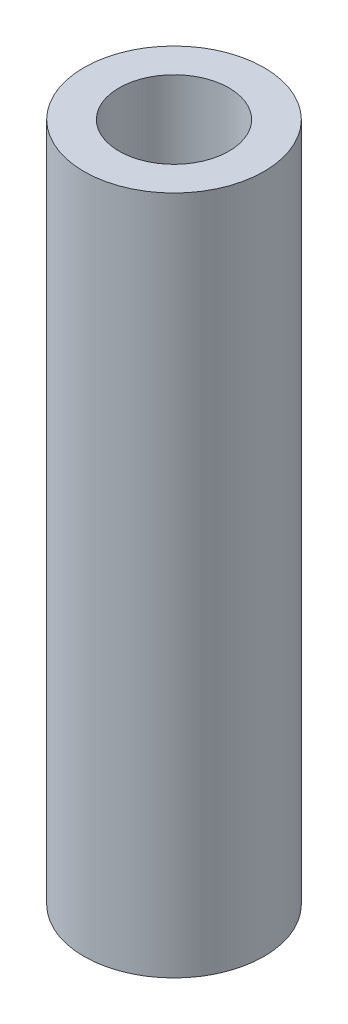
ISO-10303-21;
HEADER;
FILE_DESCRIPTION(('STEP AP214'),'2;1');
FILE_NAME('part.step','',(''),(''),'','','');
FILE_SCHEMA(('AUTOMOTIVE_DESIGN { 1 0 10303 214 1 1 1 1 }'));
ENDSEC;
DATA;
#1=APPLICATION_CONTEXT('core data for automotive mechanical design processes');
#2=APPLICATION_PROTOCOL_DEFINITION('international standard','automotive_design',2000,#1);
#3=PRODUCT_CONTEXT('',#1,'mechanical');
#4=PRODUCT('Part','Part','',(#3));
#5=PRODUCT_RELATED_PRODUCT_CATEGORY('part','',(#4));
#6=PRODUCT_DEFINITION_FORMATION('','',#4);
#7=PRODUCT_DEFINITION_CONTEXT('part definition',#1,'design');
#8=PRODUCT_DEFINITION('design','',#6,#7);
#9=PRODUCT_DEFINITION_SHAPE('','',#8);
#10=(LENGTH_UNIT() NAMED_UNIT(*) SI_UNIT(.MILLI.,.METRE.));
#11=(NAMED_UNIT(*) PLANE_ANGLE_UNIT() SI_UNIT($,.RADIAN.));
#12=(NAMED_UNIT(*) SI_UNIT($,.STERADIAN.) SOLID_ANGLE_UNIT());
#13=UNCERTAINTY_MEASURE_WITH_UNIT(LENGTH_MEASURE(1.E-05),#10,'distance_accuracy_value','');
#14=(GEOMETRIC_REPRESENTATION_CONTEXT(3) GLOBAL_UNCERTAINTY_ASSIGNED_CONTEXT((#13)) GLOBAL_UNIT_ASSIGNED_CONTEXT((#10,
#11,#12)) REPRESENTATION_CONTEXT('',''));
#15=CARTESIAN_POINT('',(0.,0.,0.));
#16=DIRECTION('',(0.,0.,1.));
#17=DIRECTION('',(1.,0.,0.));
#18=AXIS2_PLACEMENT_3D('',#15,#16,#17);
#19=CARTESIAN_POINT('',(59.4755457763826,-30.95,-35.5700000008553));
#20=DIRECTION('',(0.,1.,0.));
#21=DIRECTION('',(0.,0.,1.));
#22=AXIS2_PLACEMENT_3D('',#19,#20,#21);
#23=CYLINDRICAL_SURFACE('',#22,4.09999999999999);
#24=CARTESIAN_POINT('',(59.4755457763826,-30.95,-35.5700000008553));
#25=DIRECTION('',(0.,1.,0.));
#26=DIRECTION('',(0.,0.,1.));
#27=AXIS2_PLACEMENT_3D('',#24,#25,#26);
#28=CIRCLE('',#27,4.09999999999999);
#29=CARTESIAN_POINT('',(59.4755457763826,-30.95,-31.4700000008553));
#30=VERTEX_POINT('',#29);
#31=EDGE_CURVE('E10',#30,#30,#28,.T.);
#32=ORIENTED_EDGE('',*,*,#31,.T.);
#33=EDGE_LOOP('',(#32));
#34=FACE_BOUND('',#33,.T.);
#35=CARTESIAN_POINT('',(59.4755457763826,0.,-35.5700000008553));
#36=DIRECTION('',(0.,1.,0.));
#37=DIRECTION('',(0.,0.,1.));
#38=AXIS2_PLACEMENT_3D('',#35,#36,#37);
#39=CIRCLE('',#38,4.09999999999999);
#40=CARTESIAN_POINT('',(59.4755457763826,0.,-31.4700000008553));
#41=VERTEX_POINT('',#40);
#42=EDGE_CURVE('E33',#41,#41,#39,.T.);
#43=ORIENTED_EDGE('',*,*,#42,.F.);
#44=EDGE_LOOP('',(#43));
#45=FACE_BOUND('',#44,.T.);
#46=ADVANCED_FACE('F30',(#34,#45),#23,.T.);
#47=CARTESIAN_POINT('',(59.4755457763826,-30.95,-35.5700000008553));
#48=DIRECTION('',(0.,1.,0.));
#49=DIRECTION('',(0.,0.,1.));
#50=AXIS2_PLACEMENT_3D('',#47,#48,#49);
#51=PLANE('',#50);
#52=CARTESIAN_POINT('',(59.4755457763827,-30.95,-35.5700000008553));
#53=DIRECTION('',(0.,-1.,0.));
#54=DIRECTION('',(0.,0.,-1.));
#55=AXIS2_PLACEMENT_3D('',#52,#53,#54);
#56=CIRCLE('',#55,2.49999999999999);
#57=CARTESIAN_POINT('',(59.4755457763827,-30.95,-38.0700000008552));
#58=VERTEX_POINT('',#57);
#59=EDGE_CURVE('E44',#58,#58,#56,.T.);
#60=ORIENTED_EDGE('',*,*,#59,.F.);
#61=EDGE_LOOP('',(#60));
#62=FACE_BOUND('',#61,.T.);
#63=ORIENTED_EDGE('',*,*,#31,.F.);
#64=EDGE_LOOP('',(#63));
#65=FACE_BOUND('',#64,.T.);
#66=ADVANCED_FACE('F50',(#62,#65),#51,.F.);
#67=CARTESIAN_POINT('',(59.4755457763826,0.,-35.5700000008553));
#68=DIRECTION('',(0.,1.,0.));
#69=DIRECTION('',(0.,0.,1.));
#70=AXIS2_PLACEMENT_3D('',#67,#68,#69);
#71=PLANE('',#70);
#72=CARTESIAN_POINT('',(59.4755457763827,-2.15105711021124E-13,-35.5700000008553));
#73=DIRECTION('',(0.,-1.,0.));
#74=DIRECTION('',(0.,0.,-1.));
#75=AXIS2_PLACEMENT_3D('',#72,#73,#74);
#76=CIRCLE('',#75,2.49999999999999);
#77=CARTESIAN_POINT('',(59.4755457763827,-2.15105711021124E-13,-38.0700000008552));
#78=VERTEX_POINT('',#77);
#79=EDGE_CURVE('E40',#78,#78,#76,.T.);
#80=ORIENTED_EDGE('',*,*,#79,.T.);
#81=EDGE_LOOP('',(#80));
#82=FACE_BOUND('',#81,.T.);
#83=ORIENTED_EDGE('',*,*,#42,.T.);
#84=EDGE_LOOP('',(#83));
#85=FACE_BOUND('',#84,.T.);
#86=ADVANCED_FACE('F53',(#82,#85),#71,.T.);
#87=CARTESIAN_POINT('',(59.4755457763827,-30.95,-35.5700000008553));
#88=DIRECTION('',(0.,-1.,0.));
#89=DIRECTION('',(0.,0.,-1.));
#90=AXIS2_PLACEMENT_3D('',#87,#88,#89);
#91=CYLINDRICAL_SURFACE('',#90,2.49999999999999);
#92=ORIENTED_EDGE('',*,*,#79,.F.);
#93=EDGE_LOOP('',(#92));
#94=FACE_BOUND('',#93,.T.);
#95=ORIENTED_EDGE('',*,*,#59,.T.);
#96=EDGE_LOOP('',(#95));
#97=FACE_BOUND('',#96,.T.);
#98=ADVANCED_FACE('F48',(#94,#97),#91,.F.);
#99=CLOSED_SHELL('',(#46,#66,#86,#98));
#100=MANIFOLD_SOLID_BREP('B2',#99);
#101=ADVANCED_BREP_SHAPE_REPRESENTATION('',(#18,#100),#14);
#102=SHAPE_DEFINITION_REPRESENTATION(#9,#101);
ENDSEC;
END-ISO-10303-21;
